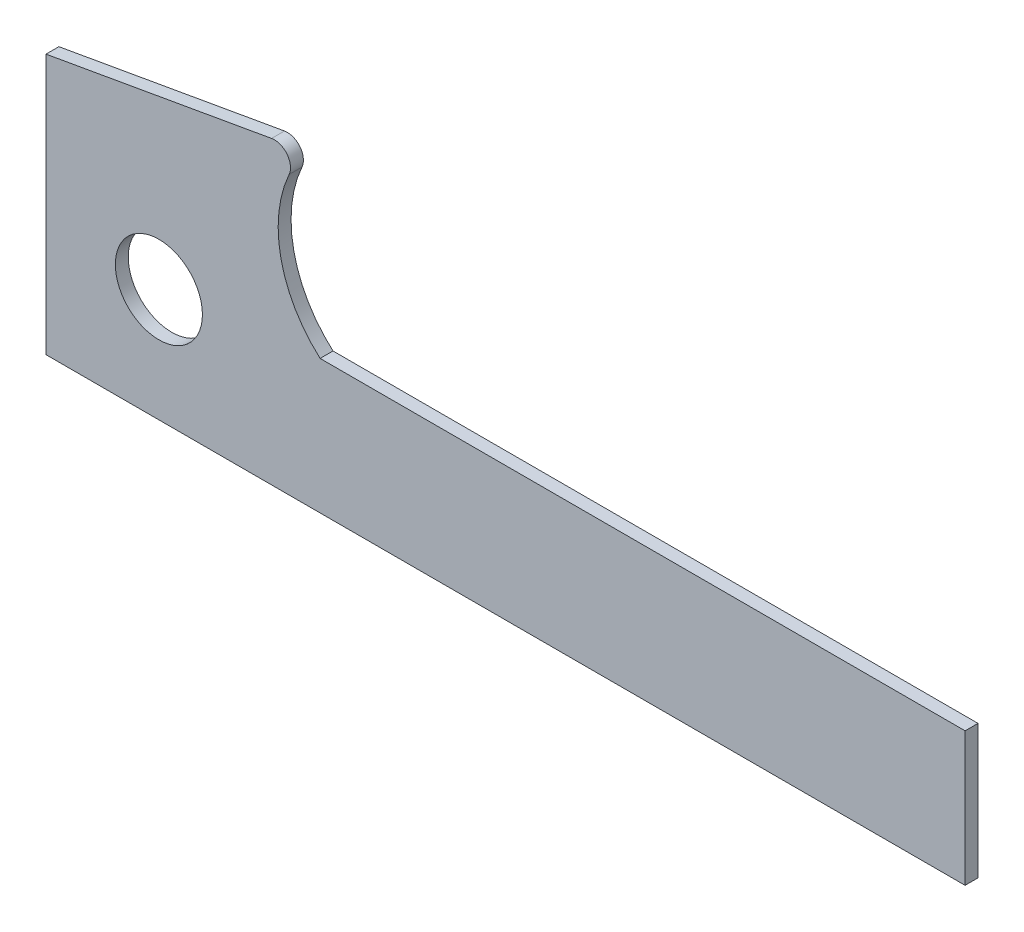
ISO-10303-21;
HEADER;
FILE_DESCRIPTION(('STEP AP214'),'2;1');
FILE_NAME('part.step','',(''),(''),'','','');
FILE_SCHEMA(('AUTOMOTIVE_DESIGN { 1 0 10303 214 1 1 1 1 }'));
ENDSEC;
DATA;
#1=APPLICATION_CONTEXT('core data for automotive mechanical design processes');
#2=APPLICATION_PROTOCOL_DEFINITION('international standard','automotive_design',2000,#1);
#3=PRODUCT_CONTEXT('',#1,'mechanical');
#4=PRODUCT('Part','Part','',(#3));
#5=PRODUCT_RELATED_PRODUCT_CATEGORY('part','',(#4));
#6=PRODUCT_DEFINITION_FORMATION('','',#4);
#7=PRODUCT_DEFINITION_CONTEXT('part definition',#1,'design');
#8=PRODUCT_DEFINITION('design','',#6,#7);
#9=PRODUCT_DEFINITION_SHAPE('','',#8);
#10=(LENGTH_UNIT() NAMED_UNIT(*) SI_UNIT(.MILLI.,.METRE.));
#11=(NAMED_UNIT(*) PLANE_ANGLE_UNIT() SI_UNIT($,.RADIAN.));
#12=(NAMED_UNIT(*) SI_UNIT($,.STERADIAN.) SOLID_ANGLE_UNIT());
#13=UNCERTAINTY_MEASURE_WITH_UNIT(LENGTH_MEASURE(1.E-05),#10,'distance_accuracy_value','');
#14=(GEOMETRIC_REPRESENTATION_CONTEXT(3) GLOBAL_UNCERTAINTY_ASSIGNED_CONTEXT((#13)) GLOBAL_UNIT_ASSIGNED_CONTEXT((#10,
#11,#12)) REPRESENTATION_CONTEXT('',''));
#15=CARTESIAN_POINT('',(0.,0.,0.));
#16=DIRECTION('',(0.,0.,1.));
#17=DIRECTION('',(1.,0.,0.));
#18=AXIS2_PLACEMENT_3D('',#15,#16,#17);
#19=CARTESIAN_POINT('',(-35.0000000000395,-35.,-4.));
#20=DIRECTION('',(-1.,0.,0.));
#21=DIRECTION('',(0.,0.,1.));
#22=AXIS2_PLACEMENT_3D('',#19,#20,#21);
#23=PLANE('',#22);
#24=DIRECTION('',(0.,-1.,0.));
#25=VECTOR('',#24,1.);
#26=CARTESIAN_POINT('',(-35.0000000000395,-35.,0.));
#27=LINE('',#26,#25);
#28=CARTESIAN_POINT('',(-35.0000000000395,45.7214323644433,0.));
#29=VERTEX_POINT('',#28);
#30=CARTESIAN_POINT('',(-35.0000000000395,-35.,0.));
#31=VERTEX_POINT('',#30);
#32=EDGE_CURVE('E142',#29,#31,#27,.T.);
#33=ORIENTED_EDGE('',*,*,#32,.F.);
#34=DIRECTION('',(0.,0.,1.));
#35=VECTOR('',#34,1.);
#36=CARTESIAN_POINT('',(-35.0000000000395,45.7214323644433,-4.));
#37=LINE('',#36,#35);
#38=CARTESIAN_POINT('',(-35.0000000000395,45.7214323644433,-4.));
#39=VERTEX_POINT('',#38);
#40=EDGE_CURVE('E49',#39,#29,#37,.T.);
#41=ORIENTED_EDGE('',*,*,#40,.F.);
#42=DIRECTION('',(0.,-1.,0.));
#43=VECTOR('',#42,1.);
#44=CARTESIAN_POINT('',(-35.0000000000395,-35.,-4.));
#45=LINE('',#44,#43);
#46=CARTESIAN_POINT('',(-35.0000000000395,-35.,-4.));
#47=VERTEX_POINT('',#46);
#48=EDGE_CURVE('E118',#39,#47,#45,.T.);
#49=ORIENTED_EDGE('',*,*,#48,.T.);
#50=DIRECTION('',(0.,0.,1.));
#51=VECTOR('',#50,1.);
#52=CARTESIAN_POINT('',(-35.0000000000395,-35.,-4.));
#53=LINE('',#52,#51);
#54=EDGE_CURVE('E11',#47,#31,#53,.T.);
#55=ORIENTED_EDGE('',*,*,#54,.T.);
#56=EDGE_LOOP('',(#33,#41,#49,#55));
#57=FACE_BOUND('',#56,.T.);
#58=ADVANCED_FACE('F39',(#57),#23,.T.);
#59=CARTESIAN_POINT('',(-35.0000000000395,45.7214323644433,-4.));
#60=DIRECTION('',(-0.173648177666927,0.984807753012209,0.));
#61=DIRECTION('',(-0.984807753012209,-0.173648177666927,0.));
#62=AXIS2_PLACEMENT_3D('',#59,#60,#61);
#63=PLANE('',#62);
#64=DIRECTION('',(-0.984807753012209,-0.173648177666927,0.));
#65=VECTOR('',#64,1.);
#66=CARTESIAN_POINT('',(-35.0000000000395,45.7214323644433,0.));
#67=LINE('',#66,#65);
#68=CARTESIAN_POINT('',(34.9487054831488,58.0552764067593,0.));
#69=VERTEX_POINT('',#68);
#70=EDGE_CURVE('E104',#69,#29,#67,.T.);
#71=ORIENTED_EDGE('',*,*,#70,.F.);
#72=DIRECTION('',(0.,0.,1.));
#73=VECTOR('',#72,1.);
#74=CARTESIAN_POINT('',(34.9487054831488,58.0552764067593,-4.));
#75=LINE('',#74,#73);
#76=CARTESIAN_POINT('',(34.9487054831488,58.0552764067593,-4.));
#77=VERTEX_POINT('',#76);
#78=EDGE_CURVE('E99',#77,#69,#75,.T.);
#79=ORIENTED_EDGE('',*,*,#78,.F.);
#80=DIRECTION('',(-0.984807753012209,-0.173648177666927,0.));
#81=VECTOR('',#80,1.);
#82=CARTESIAN_POINT('',(-35.0000000000395,45.7214323644433,-4.));
#83=LINE('',#82,#81);
#84=EDGE_CURVE('E102',#77,#39,#83,.T.);
#85=ORIENTED_EDGE('',*,*,#84,.T.);
#86=ORIENTED_EDGE('',*,*,#40,.T.);
#87=EDGE_LOOP('',(#71,#79,#85,#86));
#88=FACE_BOUND('',#87,.T.);
#89=ADVANCED_FACE('F101',(#88),#63,.T.);
#90=CARTESIAN_POINT('',(35.8169463714834,53.1312376416982,-4.));
#91=DIRECTION('',(0.,0.,1.));
#92=DIRECTION('',(1.,0.,0.));
#93=AXIS2_PLACEMENT_3D('',#90,#91,#92);
#94=CYLINDRICAL_SURFACE('',#93,5.);
#95=CARTESIAN_POINT('',(35.8169463714834,53.1312376416982,0.));
#96=DIRECTION('',(0.,0.,1.));
#97=DIRECTION('',(1.,0.,0.));
#98=AXIS2_PLACEMENT_3D('',#95,#96,#97);
#99=CIRCLE('',#98,5.);
#100=CARTESIAN_POINT('',(40.3760846745368,51.0783718561117,0.));
#101=VERTEX_POINT('',#100);
#102=EDGE_CURVE('E139',#101,#69,#99,.T.);
#103=ORIENTED_EDGE('',*,*,#102,.F.);
#104=DIRECTION('',(0.,0.,1.));
#105=VECTOR('',#104,1.);
#106=CARTESIAN_POINT('',(40.3760846745368,51.0783718561117,-4.));
#107=LINE('',#106,#105);
#108=CARTESIAN_POINT('',(40.3760846745368,51.0783718561117,-4.));
#109=VERTEX_POINT('',#108);
#110=EDGE_CURVE('E109',#109,#101,#107,.T.);
#111=ORIENTED_EDGE('',*,*,#110,.F.);
#112=CARTESIAN_POINT('',(35.8169463714834,53.1312376416982,-4.));
#113=DIRECTION('',(0.,0.,1.));
#114=DIRECTION('',(1.,0.,0.));
#115=AXIS2_PLACEMENT_3D('',#112,#113,#114);
#116=CIRCLE('',#115,5.);
#117=EDGE_CURVE('E115',#109,#77,#116,.T.);
#118=ORIENTED_EDGE('',*,*,#117,.T.);
#119=ORIENTED_EDGE('',*,*,#78,.T.);
#120=EDGE_LOOP('',(#103,#111,#118,#119));
#121=FACE_BOUND('',#120,.T.);
#122=ADVANCED_FACE('F120',(#121),#94,.T.);
#123=CARTESIAN_POINT('',(75.3946089486041,35.3104074809536,-4.));
#124=DIRECTION('',(0.,0.,1.));
#125=DIRECTION('',(1.,0.,0.));
#126=AXIS2_PLACEMENT_3D('',#123,#124,#125);
#127=CYLINDRICAL_SURFACE('',#126,38.4047619816827);
#128=CARTESIAN_POINT('',(75.3946089486041,35.3104074809536,0.));
#129=DIRECTION('',(0.,0.,-1.));
#130=DIRECTION('',(-1.,0.,0.));
#131=AXIS2_PLACEMENT_3D('',#128,#129,#130);
#132=CIRCLE('',#131,38.4047619816827);
#133=CARTESIAN_POINT('',(50.,6.50000000002452,0.));
#134=VERTEX_POINT('',#133);
#135=EDGE_CURVE('E136',#134,#101,#132,.T.);
#136=ORIENTED_EDGE('',*,*,#135,.F.);
#137=DIRECTION('',(0.,0.,1.));
#138=VECTOR('',#137,1.);
#139=CARTESIAN_POINT('',(50.,6.50000000002452,-4.));
#140=LINE('',#139,#138);
#141=CARTESIAN_POINT('',(50.,6.50000000002452,-4.));
#142=VERTEX_POINT('',#141);
#143=EDGE_CURVE('E147',#142,#134,#140,.T.);
#144=ORIENTED_EDGE('',*,*,#143,.F.);
#145=CARTESIAN_POINT('',(75.3946089486041,35.3104074809536,-4.));
#146=DIRECTION('',(0.,0.,-1.));
#147=DIRECTION('',(-1.,0.,0.));
#148=AXIS2_PLACEMENT_3D('',#145,#146,#147);
#149=CIRCLE('',#148,38.4047619816827);
#150=EDGE_CURVE('E121',#142,#109,#149,.T.);
#151=ORIENTED_EDGE('',*,*,#150,.T.);
#152=ORIENTED_EDGE('',*,*,#110,.T.);
#153=EDGE_LOOP('',(#136,#144,#151,#152));
#154=FACE_BOUND('',#153,.T.);
#155=ADVANCED_FACE('F170',(#154),#127,.F.);
#156=CARTESIAN_POINT('',(50.,6.50000000002451,-4.));
#157=DIRECTION('',(0.,1.,0.));
#158=DIRECTION('',(-1.,0.,0.));
#159=AXIS2_PLACEMENT_3D('',#156,#157,#158);
#160=PLANE('',#159);
#161=DIRECTION('',(-1.,0.,0.));
#162=VECTOR('',#161,1.);
#163=CARTESIAN_POINT('',(50.,6.50000000002451,0.));
#164=LINE('',#163,#162);
#165=CARTESIAN_POINT('',(250.,6.50000000002454,0.));
#166=VERTEX_POINT('',#165);
#167=EDGE_CURVE('E133',#166,#134,#164,.T.);
#168=ORIENTED_EDGE('',*,*,#167,.F.);
#169=DIRECTION('',(0.,0.,1.));
#170=VECTOR('',#169,1.);
#171=CARTESIAN_POINT('',(250.,6.50000000002454,-4.));
#172=LINE('',#171,#170);
#173=CARTESIAN_POINT('',(250.,6.50000000002454,-4.));
#174=VERTEX_POINT('',#173);
#175=EDGE_CURVE('E148',#174,#166,#172,.T.);
#176=ORIENTED_EDGE('',*,*,#175,.F.);
#177=DIRECTION('',(-1.,0.,0.));
#178=VECTOR('',#177,1.);
#179=CARTESIAN_POINT('',(50.,6.50000000002451,-4.));
#180=LINE('',#179,#178);
#181=EDGE_CURVE('E123',#174,#142,#180,.T.);
#182=ORIENTED_EDGE('',*,*,#181,.T.);
#183=ORIENTED_EDGE('',*,*,#143,.T.);
#184=EDGE_LOOP('',(#168,#176,#182,#183));
#185=FACE_BOUND('',#184,.T.);
#186=ADVANCED_FACE('F173',(#185),#160,.T.);
#187=CARTESIAN_POINT('',(250.,-35.,-4.));
#188=DIRECTION('',(1.,0.,0.));
#189=DIRECTION('',(0.,1.,0.));
#190=AXIS2_PLACEMENT_3D('',#187,#188,#189);
#191=PLANE('',#190);
#192=DIRECTION('',(0.,1.,0.));
#193=VECTOR('',#192,1.);
#194=CARTESIAN_POINT('',(250.,-35.,0.));
#195=LINE('',#194,#193);
#196=CARTESIAN_POINT('',(250.,-35.,0.));
#197=VERTEX_POINT('',#196);
#198=EDGE_CURVE('E129',#197,#166,#195,.T.);
#199=ORIENTED_EDGE('',*,*,#198,.F.);
#200=DIRECTION('',(0.,0.,1.));
#201=VECTOR('',#200,1.);
#202=CARTESIAN_POINT('',(250.,-35.,-4.));
#203=LINE('',#202,#201);
#204=CARTESIAN_POINT('',(250.,-35.,-4.));
#205=VERTEX_POINT('',#204);
#206=EDGE_CURVE('E43',#205,#197,#203,.T.);
#207=ORIENTED_EDGE('',*,*,#206,.F.);
#208=DIRECTION('',(0.,1.,0.));
#209=VECTOR('',#208,1.);
#210=CARTESIAN_POINT('',(250.,-35.,-4.));
#211=LINE('',#210,#209);
#212=EDGE_CURVE('E205',#205,#174,#211,.T.);
#213=ORIENTED_EDGE('',*,*,#212,.T.);
#214=ORIENTED_EDGE('',*,*,#175,.T.);
#215=EDGE_LOOP('',(#199,#207,#213,#214));
#216=FACE_BOUND('',#215,.T.);
#217=ADVANCED_FACE('F154',(#216),#191,.T.);
#218=CARTESIAN_POINT('',(0.,-35.,-4.));
#219=DIRECTION('',(0.,-1.,0.));
#220=DIRECTION('',(1.,0.,0.));
#221=AXIS2_PLACEMENT_3D('',#218,#219,#220);
#222=PLANE('',#221);
#223=DIRECTION('',(1.,0.,0.));
#224=VECTOR('',#223,1.);
#225=CARTESIAN_POINT('',(0.,-35.,0.));
#226=LINE('',#225,#224);
#227=EDGE_CURVE('E85',#31,#197,#226,.T.);
#228=ORIENTED_EDGE('',*,*,#227,.F.);
#229=ORIENTED_EDGE('',*,*,#54,.F.);
#230=DIRECTION('',(1.,0.,0.));
#231=VECTOR('',#230,1.);
#232=CARTESIAN_POINT('',(-35.0000000000395,-35.,-4.));
#233=LINE('',#232,#231);
#234=EDGE_CURVE('E88',#47,#205,#233,.T.);
#235=ORIENTED_EDGE('',*,*,#234,.T.);
#236=ORIENTED_EDGE('',*,*,#206,.T.);
#237=EDGE_LOOP('',(#228,#229,#235,#236));
#238=FACE_BOUND('',#237,.T.);
#239=ADVANCED_FACE('F41',(#238),#222,.T.);
#240=CARTESIAN_POINT('',(75.3946089486041,35.3104074809536,-4.));
#241=DIRECTION('',(0.,0.,-1.));
#242=DIRECTION('',(-1.,0.,0.));
#243=AXIS2_PLACEMENT_3D('',#240,#241,#242);
#244=PLANE('',#243);
#245=CARTESIAN_POINT('',(-3.94961841010399E-11,-2.56739074444567E-11,-4.));
#246=DIRECTION('',(0.,0.,1.));
#247=DIRECTION('',(1.,0.,0.));
#248=AXIS2_PLACEMENT_3D('',#245,#246,#247);
#249=CIRCLE('',#248,13.5);
#250=CARTESIAN_POINT('',(13.4999999999605,-2.56739074444567E-11,-4.));
#251=VERTEX_POINT('',#250);
#252=EDGE_CURVE('E130',#251,#251,#249,.T.);
#253=ORIENTED_EDGE('',*,*,#252,.T.);
#254=EDGE_LOOP('',(#253));
#255=FACE_BOUND('',#254,.T.);
#256=ORIENTED_EDGE('',*,*,#234,.F.);
#257=ORIENTED_EDGE('',*,*,#48,.F.);
#258=ORIENTED_EDGE('',*,*,#84,.F.);
#259=ORIENTED_EDGE('',*,*,#117,.F.);
#260=ORIENTED_EDGE('',*,*,#150,.F.);
#261=ORIENTED_EDGE('',*,*,#181,.F.);
#262=ORIENTED_EDGE('',*,*,#212,.F.);
#263=EDGE_LOOP('',(#256,#257,#258,#259,#260,#261,#262));
#264=FACE_BOUND('',#263,.T.);
#265=ADVANCED_FACE('F113',(#255,#264),#244,.T.);
#266=CARTESIAN_POINT('',(75.3946089486041,35.3104074809536,0.));
#267=DIRECTION('',(0.,0.,-1.));
#268=DIRECTION('',(-1.,0.,0.));
#269=AXIS2_PLACEMENT_3D('',#266,#267,#268);
#270=PLANE('',#269);
#271=CARTESIAN_POINT('',(-3.94961841010399E-11,-2.56739074444567E-11,0.));
#272=DIRECTION('',(0.,0.,1.));
#273=DIRECTION('',(1.,0.,0.));
#274=AXIS2_PLACEMENT_3D('',#271,#272,#273);
#275=CIRCLE('',#274,13.5);
#276=CARTESIAN_POINT('',(13.4999999999605,-2.56739074444567E-11,0.));
#277=VERTEX_POINT('',#276);
#278=EDGE_CURVE('E200',#277,#277,#275,.T.);
#279=ORIENTED_EDGE('',*,*,#278,.F.);
#280=EDGE_LOOP('',(#279));
#281=FACE_BOUND('',#280,.T.);
#282=ORIENTED_EDGE('',*,*,#32,.T.);
#283=ORIENTED_EDGE('',*,*,#227,.T.);
#284=ORIENTED_EDGE('',*,*,#198,.T.);
#285=ORIENTED_EDGE('',*,*,#167,.T.);
#286=ORIENTED_EDGE('',*,*,#135,.T.);
#287=ORIENTED_EDGE('',*,*,#102,.T.);
#288=ORIENTED_EDGE('',*,*,#70,.T.);
#289=EDGE_LOOP('',(#282,#283,#284,#285,#286,#287,#288));
#290=FACE_BOUND('',#289,.T.);
#291=ADVANCED_FACE('F156',(#281,#290),#270,.F.);
#292=CARTESIAN_POINT('',(-3.94961841010399E-11,-2.56739074444567E-11,-4.));
#293=DIRECTION('',(0.,0.,1.));
#294=DIRECTION('',(1.,0.,0.));
#295=AXIS2_PLACEMENT_3D('',#292,#293,#294);
#296=CYLINDRICAL_SURFACE('',#295,13.5);
#297=ORIENTED_EDGE('',*,*,#252,.F.);
#298=EDGE_LOOP('',(#297));
#299=FACE_BOUND('',#298,.T.);
#300=ORIENTED_EDGE('',*,*,#278,.T.);
#301=EDGE_LOOP('',(#300));
#302=FACE_BOUND('',#301,.T.);
#303=ADVANCED_FACE('F188',(#299,#302),#296,.F.);
#304=CLOSED_SHELL('',(#58,#89,#122,#155,#186,#217,#239,#265,#291,#303));
#305=MANIFOLD_SOLID_BREP('B2',#304);
#306=ADVANCED_BREP_SHAPE_REPRESENTATION('',(#18,#305),#14);
#307=SHAPE_DEFINITION_REPRESENTATION(#9,#306);
ENDSEC;
END-ISO-10303-21;
